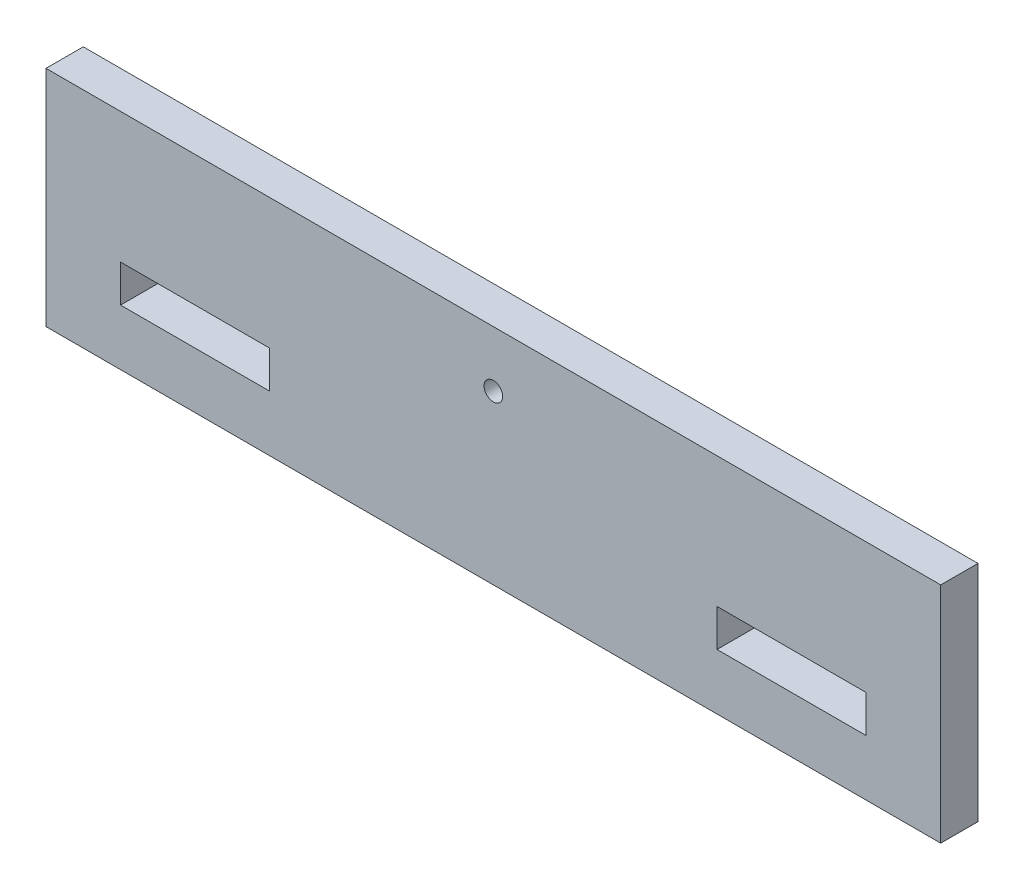
ISO-10303-21;
HEADER;
FILE_DESCRIPTION(('STEP AP214'),'2;1');
FILE_NAME('part.step','',(''),(''),'','','');
FILE_SCHEMA(('AUTOMOTIVE_DESIGN { 1 0 10303 214 1 1 1 1 }'));
ENDSEC;
DATA;
#1=APPLICATION_CONTEXT('core data for automotive mechanical design processes');
#2=APPLICATION_PROTOCOL_DEFINITION('international standard','automotive_design',2000,#1);
#3=PRODUCT_CONTEXT('',#1,'mechanical');
#4=PRODUCT('Part','Part','',(#3));
#5=PRODUCT_RELATED_PRODUCT_CATEGORY('part','',(#4));
#6=PRODUCT_DEFINITION_FORMATION('','',#4);
#7=PRODUCT_DEFINITION_CONTEXT('part definition',#1,'design');
#8=PRODUCT_DEFINITION('design','',#6,#7);
#9=PRODUCT_DEFINITION_SHAPE('','',#8);
#10=(LENGTH_UNIT() NAMED_UNIT(*) SI_UNIT(.MILLI.,.METRE.));
#11=(NAMED_UNIT(*) PLANE_ANGLE_UNIT() SI_UNIT($,.RADIAN.));
#12=(NAMED_UNIT(*) SI_UNIT($,.STERADIAN.) SOLID_ANGLE_UNIT());
#13=UNCERTAINTY_MEASURE_WITH_UNIT(LENGTH_MEASURE(1.E-05),#10,'distance_accuracy_value','');
#14=(GEOMETRIC_REPRESENTATION_CONTEXT(3) GLOBAL_UNCERTAINTY_ASSIGNED_CONTEXT((#13)) GLOBAL_UNIT_ASSIGNED_CONTEXT((#10,
#11,#12)) REPRESENTATION_CONTEXT('',''));
#15=CARTESIAN_POINT('',(0.,0.,0.));
#16=DIRECTION('',(0.,0.,1.));
#17=DIRECTION('',(1.,0.,0.));
#18=AXIS2_PLACEMENT_3D('',#15,#16,#17);
#19=CARTESIAN_POINT('',(6.35,38.1,6.35));
#20=DIRECTION('',(0.,-1.,0.));
#21=DIRECTION('',(0.,0.,-1.));
#22=AXIS2_PLACEMENT_3D('',#19,#20,#21);
#23=PLANE('',#22);
#24=DIRECTION('',(-1.,0.,0.));
#25=VECTOR('',#24,1.);
#26=CARTESIAN_POINT('',(6.35,38.1,0.));
#27=LINE('',#26,#25);
#28=CARTESIAN_POINT('',(152.4,38.1,0.));
#29=VERTEX_POINT('',#28);
#30=CARTESIAN_POINT('',(0.,38.1,0.));
#31=VERTEX_POINT('',#30);
#32=EDGE_CURVE('E186',#29,#31,#27,.T.);
#33=ORIENTED_EDGE('',*,*,#32,.T.);
#34=DIRECTION('',(0.,0.,-1.));
#35=VECTOR('',#34,1.);
#36=CARTESIAN_POINT('',(0.,38.1,6.35));
#37=LINE('',#36,#35);
#38=CARTESIAN_POINT('',(0.,38.1,6.35));
#39=VERTEX_POINT('',#38);
#40=EDGE_CURVE('E39',#39,#31,#37,.T.);
#41=ORIENTED_EDGE('',*,*,#40,.F.);
#42=DIRECTION('',(-1.,0.,0.));
#43=VECTOR('',#42,1.);
#44=CARTESIAN_POINT('',(146.05,38.1,6.35));
#45=LINE('',#44,#43);
#46=CARTESIAN_POINT('',(152.4,38.1,6.35));
#47=VERTEX_POINT('',#46);
#48=EDGE_CURVE('E196',#47,#39,#45,.T.);
#49=ORIENTED_EDGE('',*,*,#48,.F.);
#50=DIRECTION('',(0.,0.,-1.));
#51=VECTOR('',#50,1.);
#52=CARTESIAN_POINT('',(152.4,38.1,6.35));
#53=LINE('',#52,#51);
#54=EDGE_CURVE('E11',#47,#29,#53,.T.);
#55=ORIENTED_EDGE('',*,*,#54,.T.);
#56=EDGE_LOOP('',(#33,#41,#49,#55));
#57=FACE_BOUND('',#56,.T.);
#58=ADVANCED_FACE('F32',(#57),#23,.F.);
#59=CARTESIAN_POINT('',(0.,12.7,6.35));
#60=DIRECTION('',(1.,0.,0.));
#61=DIRECTION('',(0.,1.,0.));
#62=AXIS2_PLACEMENT_3D('',#59,#60,#61);
#63=PLANE('',#62);
#64=DIRECTION('',(0.,-1.,0.));
#65=VECTOR('',#64,1.);
#66=CARTESIAN_POINT('',(0.,12.7,0.));
#67=LINE('',#66,#65);
#68=CARTESIAN_POINT('',(0.,0.,0.));
#69=VERTEX_POINT('',#68);
#70=EDGE_CURVE('E206',#31,#69,#67,.T.);
#71=ORIENTED_EDGE('',*,*,#70,.T.);
#72=DIRECTION('',(0.,0.,-1.));
#73=VECTOR('',#72,1.);
#74=CARTESIAN_POINT('',(0.,0.,6.35));
#75=LINE('',#74,#73);
#76=CARTESIAN_POINT('',(0.,0.,6.35));
#77=VERTEX_POINT('',#76);
#78=EDGE_CURVE('E216',#77,#69,#75,.T.);
#79=ORIENTED_EDGE('',*,*,#78,.F.);
#80=DIRECTION('',(0.,-1.,0.));
#81=VECTOR('',#80,1.);
#82=CARTESIAN_POINT('',(0.,25.4,6.35));
#83=LINE('',#82,#81);
#84=EDGE_CURVE('E199',#39,#77,#83,.T.);
#85=ORIENTED_EDGE('',*,*,#84,.F.);
#86=ORIENTED_EDGE('',*,*,#40,.T.);
#87=EDGE_LOOP('',(#71,#79,#85,#86));
#88=FACE_BOUND('',#87,.T.);
#89=ADVANCED_FACE('F222',(#88),#63,.F.);
#90=CARTESIAN_POINT('',(152.4,0.,6.35));
#91=DIRECTION('',(0.,1.,0.));
#92=DIRECTION('',(0.,0.,1.));
#93=AXIS2_PLACEMENT_3D('',#90,#91,#92);
#94=PLANE('',#93);
#95=DIRECTION('',(1.,0.,0.));
#96=VECTOR('',#95,1.);
#97=CARTESIAN_POINT('',(152.4,0.,0.));
#98=LINE('',#97,#96);
#99=CARTESIAN_POINT('',(152.4,0.,0.));
#100=VERTEX_POINT('',#99);
#101=EDGE_CURVE('E209',#69,#100,#98,.T.);
#102=ORIENTED_EDGE('',*,*,#101,.T.);
#103=DIRECTION('',(0.,0.,-1.));
#104=VECTOR('',#103,1.);
#105=CARTESIAN_POINT('',(152.4,0.,6.35));
#106=LINE('',#105,#104);
#107=CARTESIAN_POINT('',(152.4,0.,6.35));
#108=VERTEX_POINT('',#107);
#109=EDGE_CURVE('E203',#108,#100,#106,.T.);
#110=ORIENTED_EDGE('',*,*,#109,.F.);
#111=DIRECTION('',(1.,0.,0.));
#112=VECTOR('',#111,1.);
#113=CARTESIAN_POINT('',(0.,0.,6.35));
#114=LINE('',#113,#112);
#115=EDGE_CURVE('E201',#77,#108,#114,.T.);
#116=ORIENTED_EDGE('',*,*,#115,.F.);
#117=ORIENTED_EDGE('',*,*,#78,.T.);
#118=EDGE_LOOP('',(#102,#110,#116,#117));
#119=FACE_BOUND('',#118,.T.);
#120=ADVANCED_FACE('F233',(#119),#94,.F.);
#121=CARTESIAN_POINT('',(152.4,25.4,6.35));
#122=DIRECTION('',(-1.,0.,0.));
#123=DIRECTION('',(0.,0.,1.));
#124=AXIS2_PLACEMENT_3D('',#121,#122,#123);
#125=PLANE('',#124);
#126=DIRECTION('',(0.,1.,0.));
#127=VECTOR('',#126,1.);
#128=CARTESIAN_POINT('',(152.4,25.4,0.));
#129=LINE('',#128,#127);
#130=EDGE_CURVE('E197',#100,#29,#129,.T.);
#131=ORIENTED_EDGE('',*,*,#130,.T.);
#132=ORIENTED_EDGE('',*,*,#54,.F.);
#133=DIRECTION('',(0.,1.,0.));
#134=VECTOR('',#133,1.);
#135=CARTESIAN_POINT('',(152.4,38.1,6.35));
#136=LINE('',#135,#134);
#137=EDGE_CURVE('E193',#108,#47,#136,.T.);
#138=ORIENTED_EDGE('',*,*,#137,.F.);
#139=ORIENTED_EDGE('',*,*,#109,.T.);
#140=EDGE_LOOP('',(#131,#132,#138,#139));
#141=FACE_BOUND('',#140,.T.);
#142=ADVANCED_FACE('F228',(#141),#125,.F.);
#143=CARTESIAN_POINT('',(0.,0.,6.35));
#144=DIRECTION('',(0.,0.,-1.));
#145=DIRECTION('',(-1.,0.,0.));
#146=AXIS2_PLACEMENT_3D('',#143,#144,#145);
#147=PLANE('',#146);
#148=CARTESIAN_POINT('',(76.2,28.575,6.35));
#149=DIRECTION('',(0.,0.,1.));
#150=DIRECTION('',(1.,0.,0.));
#151=AXIS2_PLACEMENT_3D('',#148,#149,#150);
#152=CIRCLE('',#151,1.5875);
#153=CARTESIAN_POINT('',(77.7875,28.575,6.35));
#154=VERTEX_POINT('',#153);
#155=EDGE_CURVE('E144',#154,#154,#152,.T.);
#156=ORIENTED_EDGE('',*,*,#155,.F.);
#157=EDGE_LOOP('',(#156));
#158=FACE_BOUND('',#157,.T.);
#159=DIRECTION('',(1.,0.,0.));
#160=VECTOR('',#159,1.);
#161=CARTESIAN_POINT('',(114.3,9.525,6.35));
#162=LINE('',#161,#160);
#163=CARTESIAN_POINT('',(114.3,9.525,6.35));
#164=VERTEX_POINT('',#163);
#165=CARTESIAN_POINT('',(139.7,9.525,6.35));
#166=VERTEX_POINT('',#165);
#167=EDGE_CURVE('E150',#164,#166,#162,.T.);
#168=ORIENTED_EDGE('',*,*,#167,.F.);
#169=DIRECTION('',(0.,-1.,0.));
#170=VECTOR('',#169,1.);
#171=CARTESIAN_POINT('',(114.3,9.525,6.35));
#172=LINE('',#171,#170);
#173=CARTESIAN_POINT('',(114.3,15.875,6.35));
#174=VERTEX_POINT('',#173);
#175=EDGE_CURVE('E46',#174,#164,#172,.T.);
#176=ORIENTED_EDGE('',*,*,#175,.F.);
#177=DIRECTION('',(-1.,0.,0.));
#178=VECTOR('',#177,1.);
#179=CARTESIAN_POINT('',(114.3,15.875,6.35));
#180=LINE('',#179,#178);
#181=CARTESIAN_POINT('',(139.7,15.875,6.35));
#182=VERTEX_POINT('',#181);
#183=EDGE_CURVE('E138',#182,#174,#180,.T.);
#184=ORIENTED_EDGE('',*,*,#183,.F.);
#185=DIRECTION('',(0.,1.,0.));
#186=VECTOR('',#185,1.);
#187=CARTESIAN_POINT('',(139.7,9.525,6.35));
#188=LINE('',#187,#186);
#189=EDGE_CURVE('E141',#166,#182,#188,.T.);
#190=ORIENTED_EDGE('',*,*,#189,.F.);
#191=EDGE_LOOP('',(#168,#176,#184,#190));
#192=FACE_BOUND('',#191,.T.);
#193=DIRECTION('',(1.,0.,0.));
#194=VECTOR('',#193,1.);
#195=CARTESIAN_POINT('',(12.7,9.525,6.35));
#196=LINE('',#195,#194);
#197=CARTESIAN_POINT('',(12.7,9.525,6.35));
#198=VERTEX_POINT('',#197);
#199=CARTESIAN_POINT('',(38.1,9.525,6.35));
#200=VERTEX_POINT('',#199);
#201=EDGE_CURVE('E176',#198,#200,#196,.T.);
#202=ORIENTED_EDGE('',*,*,#201,.F.);
#203=DIRECTION('',(0.,-1.,0.));
#204=VECTOR('',#203,1.);
#205=CARTESIAN_POINT('',(12.7,15.875,6.35));
#206=LINE('',#205,#204);
#207=CARTESIAN_POINT('',(12.7,15.875,6.35));
#208=VERTEX_POINT('',#207);
#209=EDGE_CURVE('E157',#208,#198,#206,.T.);
#210=ORIENTED_EDGE('',*,*,#209,.F.);
#211=DIRECTION('',(-1.,0.,0.));
#212=VECTOR('',#211,1.);
#213=CARTESIAN_POINT('',(12.7,15.875,6.35));
#214=LINE('',#213,#212);
#215=CARTESIAN_POINT('',(38.1,15.875,6.35));
#216=VERTEX_POINT('',#215);
#217=EDGE_CURVE('E165',#216,#208,#214,.T.);
#218=ORIENTED_EDGE('',*,*,#217,.F.);
#219=DIRECTION('',(0.,1.,0.));
#220=VECTOR('',#219,1.);
#221=CARTESIAN_POINT('',(38.1,15.875,6.35));
#222=LINE('',#221,#220);
#223=EDGE_CURVE('E179',#200,#216,#222,.T.);
#224=ORIENTED_EDGE('',*,*,#223,.F.);
#225=EDGE_LOOP('',(#202,#210,#218,#224));
#226=FACE_BOUND('',#225,.T.);
#227=ORIENTED_EDGE('',*,*,#137,.T.);
#228=ORIENTED_EDGE('',*,*,#48,.T.);
#229=ORIENTED_EDGE('',*,*,#84,.T.);
#230=ORIENTED_EDGE('',*,*,#115,.T.);
#231=EDGE_LOOP('',(#227,#228,#229,#230));
#232=FACE_BOUND('',#231,.T.);
#233=ADVANCED_FACE('F235',(#158,#192,#226,#232),#147,.F.);
#234=CARTESIAN_POINT('',(0.,0.,0.));
#235=DIRECTION('',(0.,0.,-1.));
#236=DIRECTION('',(-1.,0.,0.));
#237=AXIS2_PLACEMENT_3D('',#234,#235,#236);
#238=PLANE('',#237);
#239=CARTESIAN_POINT('',(76.2,28.575,0.));
#240=DIRECTION('',(0.,0.,1.));
#241=DIRECTION('',(1.,0.,0.));
#242=AXIS2_PLACEMENT_3D('',#239,#240,#241);
#243=CIRCLE('',#242,1.5875);
#244=CARTESIAN_POINT('',(77.7875,28.575,0.));
#245=VERTEX_POINT('',#244);
#246=EDGE_CURVE('E151',#245,#245,#243,.T.);
#247=ORIENTED_EDGE('',*,*,#246,.T.);
#248=EDGE_LOOP('',(#247));
#249=FACE_BOUND('',#248,.T.);
#250=DIRECTION('',(0.,-1.,0.));
#251=VECTOR('',#250,1.);
#252=CARTESIAN_POINT('',(114.3,9.525,0.));
#253=LINE('',#252,#251);
#254=CARTESIAN_POINT('',(114.3,15.875,0.));
#255=VERTEX_POINT('',#254);
#256=CARTESIAN_POINT('',(114.3,9.525,0.));
#257=VERTEX_POINT('',#256);
#258=EDGE_CURVE('E122',#255,#257,#253,.T.);
#259=ORIENTED_EDGE('',*,*,#258,.T.);
#260=DIRECTION('',(1.,0.,0.));
#261=VECTOR('',#260,1.);
#262=CARTESIAN_POINT('',(114.3,9.525,0.));
#263=LINE('',#262,#261);
#264=CARTESIAN_POINT('',(139.7,9.525,0.));
#265=VERTEX_POINT('',#264);
#266=EDGE_CURVE('E131',#257,#265,#263,.T.);
#267=ORIENTED_EDGE('',*,*,#266,.T.);
#268=DIRECTION('',(0.,1.,0.));
#269=VECTOR('',#268,1.);
#270=CARTESIAN_POINT('',(139.7,9.525,0.));
#271=LINE('',#270,#269);
#272=CARTESIAN_POINT('',(139.7,15.875,0.));
#273=VERTEX_POINT('',#272);
#274=EDGE_CURVE('E54',#265,#273,#271,.T.);
#275=ORIENTED_EDGE('',*,*,#274,.T.);
#276=DIRECTION('',(-1.,0.,0.));
#277=VECTOR('',#276,1.);
#278=CARTESIAN_POINT('',(114.3,15.875,0.));
#279=LINE('',#278,#277);
#280=EDGE_CURVE('E128',#273,#255,#279,.T.);
#281=ORIENTED_EDGE('',*,*,#280,.T.);
#282=EDGE_LOOP('',(#259,#267,#275,#281));
#283=FACE_BOUND('',#282,.T.);
#284=DIRECTION('',(0.,-1.,0.));
#285=VECTOR('',#284,1.);
#286=CARTESIAN_POINT('',(12.7,15.875,0.));
#287=LINE('',#286,#285);
#288=CARTESIAN_POINT('',(12.7,15.875,0.));
#289=VERTEX_POINT('',#288);
#290=CARTESIAN_POINT('',(12.7,9.525,0.));
#291=VERTEX_POINT('',#290);
#292=EDGE_CURVE('E161',#289,#291,#287,.T.);
#293=ORIENTED_EDGE('',*,*,#292,.T.);
#294=DIRECTION('',(1.,0.,0.));
#295=VECTOR('',#294,1.);
#296=CARTESIAN_POINT('',(12.7,9.525,0.));
#297=LINE('',#296,#295);
#298=CARTESIAN_POINT('',(38.1,9.525,0.));
#299=VERTEX_POINT('',#298);
#300=EDGE_CURVE('E164',#291,#299,#297,.T.);
#301=ORIENTED_EDGE('',*,*,#300,.T.);
#302=DIRECTION('',(0.,1.,0.));
#303=VECTOR('',#302,1.);
#304=CARTESIAN_POINT('',(38.1,15.875,0.));
#305=LINE('',#304,#303);
#306=CARTESIAN_POINT('',(38.1,15.875,0.));
#307=VERTEX_POINT('',#306);
#308=EDGE_CURVE('E168',#299,#307,#305,.T.);
#309=ORIENTED_EDGE('',*,*,#308,.T.);
#310=DIRECTION('',(-1.,0.,0.));
#311=VECTOR('',#310,1.);
#312=CARTESIAN_POINT('',(12.7,15.875,0.));
#313=LINE('',#312,#311);
#314=EDGE_CURVE('E171',#307,#289,#313,.T.);
#315=ORIENTED_EDGE('',*,*,#314,.T.);
#316=EDGE_LOOP('',(#293,#301,#309,#315));
#317=FACE_BOUND('',#316,.T.);
#318=ORIENTED_EDGE('',*,*,#32,.F.);
#319=ORIENTED_EDGE('',*,*,#130,.F.);
#320=ORIENTED_EDGE('',*,*,#101,.F.);
#321=ORIENTED_EDGE('',*,*,#70,.F.);
#322=EDGE_LOOP('',(#318,#319,#320,#321));
#323=FACE_BOUND('',#322,.T.);
#324=ADVANCED_FACE('F135',(#249,#283,#317,#323),#238,.T.);
#325=CARTESIAN_POINT('',(12.7,15.875,0.));
#326=DIRECTION('',(-1.,0.,0.));
#327=DIRECTION('',(0.,-1.,0.));
#328=AXIS2_PLACEMENT_3D('',#325,#326,#327);
#329=PLANE('',#328);
#330=ORIENTED_EDGE('',*,*,#209,.T.);
#331=DIRECTION('',(0.,0.,1.));
#332=VECTOR('',#331,1.);
#333=CARTESIAN_POINT('',(12.7,9.525,0.));
#334=LINE('',#333,#332);
#335=EDGE_CURVE('E174',#291,#198,#334,.T.);
#336=ORIENTED_EDGE('',*,*,#335,.F.);
#337=ORIENTED_EDGE('',*,*,#292,.F.);
#338=DIRECTION('',(0.,0.,1.));
#339=VECTOR('',#338,1.);
#340=CARTESIAN_POINT('',(12.7,15.875,0.));
#341=LINE('',#340,#339);
#342=EDGE_CURVE('E184',#289,#208,#341,.T.);
#343=ORIENTED_EDGE('',*,*,#342,.T.);
#344=EDGE_LOOP('',(#330,#336,#337,#343));
#345=FACE_BOUND('',#344,.T.);
#346=ADVANCED_FACE('F243',(#345),#329,.F.);
#347=CARTESIAN_POINT('',(12.7,15.875,0.));
#348=DIRECTION('',(0.,1.,0.));
#349=DIRECTION('',(0.,0.,1.));
#350=AXIS2_PLACEMENT_3D('',#347,#348,#349);
#351=PLANE('',#350);
#352=ORIENTED_EDGE('',*,*,#217,.T.);
#353=ORIENTED_EDGE('',*,*,#342,.F.);
#354=ORIENTED_EDGE('',*,*,#314,.F.);
#355=DIRECTION('',(0.,0.,1.));
#356=VECTOR('',#355,1.);
#357=CARTESIAN_POINT('',(38.1,15.875,0.));
#358=LINE('',#357,#356);
#359=EDGE_CURVE('E187',#307,#216,#358,.T.);
#360=ORIENTED_EDGE('',*,*,#359,.T.);
#361=EDGE_LOOP('',(#352,#353,#354,#360));
#362=FACE_BOUND('',#361,.T.);
#363=ADVANCED_FACE('F275',(#362),#351,.F.);
#364=CARTESIAN_POINT('',(38.1,15.875,0.));
#365=DIRECTION('',(1.,0.,0.));
#366=DIRECTION('',(0.,0.,-1.));
#367=AXIS2_PLACEMENT_3D('',#364,#365,#366);
#368=PLANE('',#367);
#369=ORIENTED_EDGE('',*,*,#223,.T.);
#370=ORIENTED_EDGE('',*,*,#359,.F.);
#371=ORIENTED_EDGE('',*,*,#308,.F.);
#372=DIRECTION('',(0.,0.,1.));
#373=VECTOR('',#372,1.);
#374=CARTESIAN_POINT('',(38.1,9.525,0.));
#375=LINE('',#374,#373);
#376=EDGE_CURVE('E189',#299,#200,#375,.T.);
#377=ORIENTED_EDGE('',*,*,#376,.T.);
#378=EDGE_LOOP('',(#369,#370,#371,#377));
#379=FACE_BOUND('',#378,.T.);
#380=ADVANCED_FACE('F285',(#379),#368,.F.);
#381=CARTESIAN_POINT('',(12.7,9.525,0.));
#382=DIRECTION('',(0.,-1.,0.));
#383=DIRECTION('',(0.,0.,-1.));
#384=AXIS2_PLACEMENT_3D('',#381,#382,#383);
#385=PLANE('',#384);
#386=ORIENTED_EDGE('',*,*,#201,.T.);
#387=ORIENTED_EDGE('',*,*,#376,.F.);
#388=ORIENTED_EDGE('',*,*,#300,.F.);
#389=ORIENTED_EDGE('',*,*,#335,.T.);
#390=EDGE_LOOP('',(#386,#387,#388,#389));
#391=FACE_BOUND('',#390,.T.);
#392=ADVANCED_FACE('F295',(#391),#385,.F.);
#393=CARTESIAN_POINT('',(114.3,9.525,0.));
#394=DIRECTION('',(-1.,0.,0.));
#395=DIRECTION('',(0.,0.,1.));
#396=AXIS2_PLACEMENT_3D('',#393,#394,#395);
#397=PLANE('',#396);
#398=ORIENTED_EDGE('',*,*,#175,.T.);
#399=DIRECTION('',(0.,0.,1.));
#400=VECTOR('',#399,1.);
#401=CARTESIAN_POINT('',(114.3,9.525,0.));
#402=LINE('',#401,#400);
#403=EDGE_CURVE('E118',#257,#164,#402,.T.);
#404=ORIENTED_EDGE('',*,*,#403,.F.);
#405=ORIENTED_EDGE('',*,*,#258,.F.);
#406=DIRECTION('',(0.,0.,1.));
#407=VECTOR('',#406,1.);
#408=CARTESIAN_POINT('',(114.3,15.875,0.));
#409=LINE('',#408,#407);
#410=EDGE_CURVE('E155',#255,#174,#409,.T.);
#411=ORIENTED_EDGE('',*,*,#410,.T.);
#412=EDGE_LOOP('',(#398,#404,#405,#411));
#413=FACE_BOUND('',#412,.T.);
#414=ADVANCED_FACE('F120',(#413),#397,.F.);
#415=CARTESIAN_POINT('',(114.3,15.875,0.));
#416=DIRECTION('',(0.,1.,0.));
#417=DIRECTION('',(0.,0.,1.));
#418=AXIS2_PLACEMENT_3D('',#415,#416,#417);
#419=PLANE('',#418);
#420=ORIENTED_EDGE('',*,*,#183,.T.);
#421=ORIENTED_EDGE('',*,*,#410,.F.);
#422=ORIENTED_EDGE('',*,*,#280,.F.);
#423=DIRECTION('',(0.,0.,1.));
#424=VECTOR('',#423,1.);
#425=CARTESIAN_POINT('',(139.7,15.875,0.));
#426=LINE('',#425,#424);
#427=EDGE_CURVE('E158',#273,#182,#426,.T.);
#428=ORIENTED_EDGE('',*,*,#427,.T.);
#429=EDGE_LOOP('',(#420,#421,#422,#428));
#430=FACE_BOUND('',#429,.T.);
#431=ADVANCED_FACE('F314',(#430),#419,.F.);
#432=CARTESIAN_POINT('',(139.7,9.525,0.));
#433=DIRECTION('',(1.,0.,0.));
#434=DIRECTION('',(0.,0.,-1.));
#435=AXIS2_PLACEMENT_3D('',#432,#433,#434);
#436=PLANE('',#435);
#437=ORIENTED_EDGE('',*,*,#189,.T.);
#438=ORIENTED_EDGE('',*,*,#427,.F.);
#439=ORIENTED_EDGE('',*,*,#274,.F.);
#440=DIRECTION('',(0.,0.,1.));
#441=VECTOR('',#440,1.);
#442=CARTESIAN_POINT('',(139.7,9.525,0.));
#443=LINE('',#442,#441);
#444=EDGE_CURVE('E127',#265,#166,#443,.T.);
#445=ORIENTED_EDGE('',*,*,#444,.T.);
#446=EDGE_LOOP('',(#437,#438,#439,#445));
#447=FACE_BOUND('',#446,.T.);
#448=ADVANCED_FACE('F323',(#447),#436,.F.);
#449=CARTESIAN_POINT('',(114.3,9.525,0.));
#450=DIRECTION('',(0.,-1.,0.));
#451=DIRECTION('',(0.,0.,-1.));
#452=AXIS2_PLACEMENT_3D('',#449,#450,#451);
#453=PLANE('',#452);
#454=ORIENTED_EDGE('',*,*,#167,.T.);
#455=ORIENTED_EDGE('',*,*,#444,.F.);
#456=ORIENTED_EDGE('',*,*,#266,.F.);
#457=ORIENTED_EDGE('',*,*,#403,.T.);
#458=EDGE_LOOP('',(#454,#455,#456,#457));
#459=FACE_BOUND('',#458,.T.);
#460=ADVANCED_FACE('F132',(#459),#453,.F.);
#461=CARTESIAN_POINT('',(76.2,28.575,0.));
#462=DIRECTION('',(0.,0.,1.));
#463=DIRECTION('',(1.,0.,0.));
#464=AXIS2_PLACEMENT_3D('',#461,#462,#463);
#465=CYLINDRICAL_SURFACE('',#464,1.5875);
#466=ORIENTED_EDGE('',*,*,#246,.F.);
#467=EDGE_LOOP('',(#466));
#468=FACE_BOUND('',#467,.T.);
#469=ORIENTED_EDGE('',*,*,#155,.T.);
#470=EDGE_LOOP('',(#469));
#471=FACE_BOUND('',#470,.T.);
#472=ADVANCED_FACE('F340',(#468,#471),#465,.F.);
#473=CLOSED_SHELL('',(#58,#89,#120,#142,#233,#324,#346,#363,#380,#392,#414,#431,#448,#460,#472));
#474=MANIFOLD_SOLID_BREP('B2',#473);
#475=ADVANCED_BREP_SHAPE_REPRESENTATION('',(#18,#474),#14);
#476=SHAPE_DEFINITION_REPRESENTATION(#9,#475);
ENDSEC;
END-ISO-10303-21;
